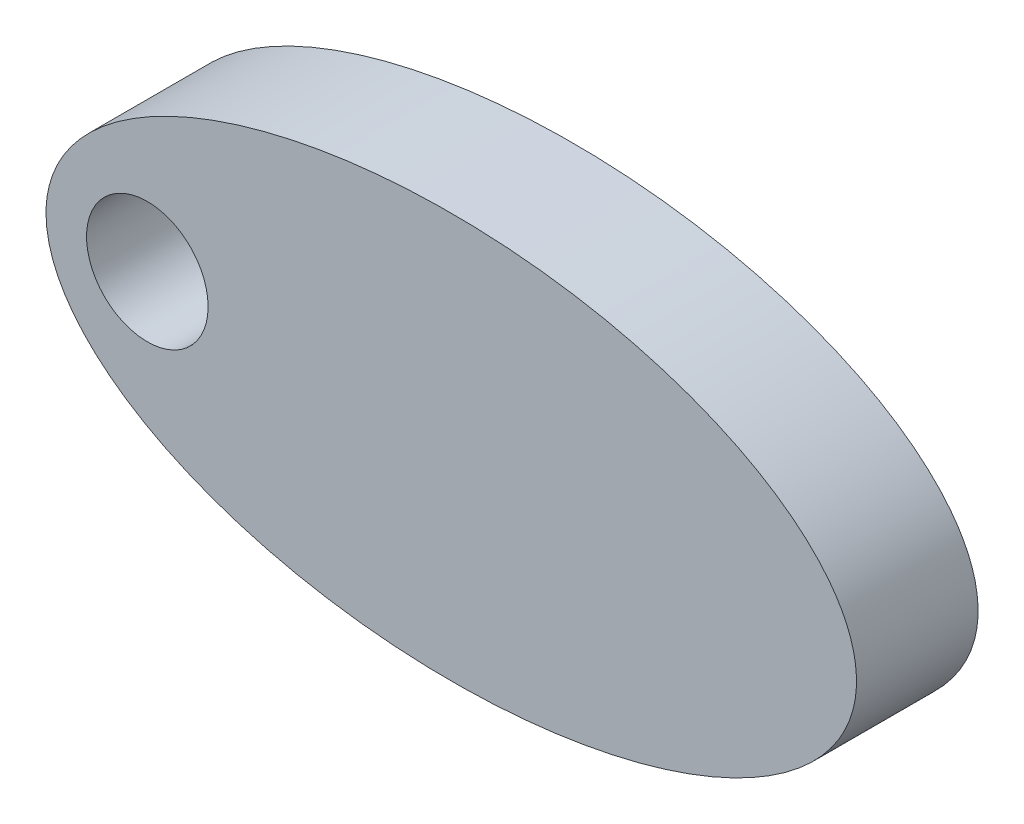
ISO-10303-21;
HEADER;
FILE_DESCRIPTION(('STEP AP214'),'2;1');
FILE_NAME('part.step','',(''),(''),'','','');
FILE_SCHEMA(('AUTOMOTIVE_DESIGN { 1 0 10303 214 1 1 1 1 }'));
ENDSEC;
DATA;
#1=APPLICATION_CONTEXT('core data for automotive mechanical design processes');
#2=APPLICATION_PROTOCOL_DEFINITION('international standard','automotive_design',2000,#1);
#3=PRODUCT_CONTEXT('',#1,'mechanical');
#4=PRODUCT('Part','Part','',(#3));
#5=PRODUCT_RELATED_PRODUCT_CATEGORY('part','',(#4));
#6=PRODUCT_DEFINITION_FORMATION('','',#4);
#7=PRODUCT_DEFINITION_CONTEXT('part definition',#1,'design');
#8=PRODUCT_DEFINITION('design','',#6,#7);
#9=PRODUCT_DEFINITION_SHAPE('','',#8);
#10=(LENGTH_UNIT() NAMED_UNIT(*) SI_UNIT(.MILLI.,.METRE.));
#11=(NAMED_UNIT(*) PLANE_ANGLE_UNIT() SI_UNIT($,.RADIAN.));
#12=(NAMED_UNIT(*) SI_UNIT($,.STERADIAN.) SOLID_ANGLE_UNIT());
#13=UNCERTAINTY_MEASURE_WITH_UNIT(LENGTH_MEASURE(1.E-05),#10,'distance_accuracy_value','');
#14=(GEOMETRIC_REPRESENTATION_CONTEXT(3) GLOBAL_UNCERTAINTY_ASSIGNED_CONTEXT((#13)) GLOBAL_UNIT_ASSIGNED_CONTEXT((#10,
#11,#12)) REPRESENTATION_CONTEXT('',''));
#15=CARTESIAN_POINT('',(0.,0.,0.));
#16=DIRECTION('',(0.,0.,1.));
#17=DIRECTION('',(1.,0.,0.));
#18=AXIS2_PLACEMENT_3D('',#15,#16,#17);
#19=CARTESIAN_POINT('',(0.,0.,3.));
#20=DIRECTION('',(0.,0.,1.));
#21=DIRECTION('',(1.,0.,0.));
#22=AXIS2_PLACEMENT_3D('',#19,#20,#21);
#23=PLANE('',#22);
#24=CARTESIAN_POINT('',(0.,0.,3.));
#25=DIRECTION('',(0.,0.,1.));
#26=DIRECTION('',(-1.,0.,0.));
#27=AXIS2_PLACEMENT_3D('',#24,#25,#26);
#28=ELLIPSE('',#27,10.,5.);
#29=CARTESIAN_POINT('',(-10.,0.,3.));
#30=VERTEX_POINT('',#29);
#31=EDGE_CURVE('E10',#30,#30,#28,.T.);
#32=ORIENTED_EDGE('',*,*,#31,.T.);
#33=EDGE_LOOP('',(#32));
#34=FACE_BOUND('',#33,.T.);
#35=CARTESIAN_POINT('',(-7.5,0.,3.));
#36=DIRECTION('',(0.,0.,1.));
#37=DIRECTION('',(1.,0.,0.));
#38=AXIS2_PLACEMENT_3D('',#35,#36,#37);
#39=CIRCLE('',#38,1.5);
#40=CARTESIAN_POINT('',(-6.,0.,3.));
#41=VERTEX_POINT('',#40);
#42=EDGE_CURVE('E44',#41,#41,#39,.T.);
#43=ORIENTED_EDGE('',*,*,#42,.F.);
#44=EDGE_LOOP('',(#43));
#45=FACE_BOUND('',#44,.T.);
#46=ADVANCED_FACE('F33',(#34,#45),#23,.T.);
#47=CARTESIAN_POINT('',(0.,0.,0.));
#48=DIRECTION('',(0.,0.,1.));
#49=DIRECTION('',(1.,0.,0.));
#50=AXIS2_PLACEMENT_3D('',#47,#48,#49);
#51=PLANE('',#50);
#52=CARTESIAN_POINT('',(0.,0.,0.));
#53=DIRECTION('',(0.,0.,1.));
#54=DIRECTION('',(-1.,0.,0.));
#55=AXIS2_PLACEMENT_3D('',#52,#53,#54);
#56=ELLIPSE('',#55,10.,5.);
#57=CARTESIAN_POINT('',(-10.,0.,0.));
#58=VERTEX_POINT('',#57);
#59=EDGE_CURVE('E38',#58,#58,#56,.T.);
#60=ORIENTED_EDGE('',*,*,#59,.F.);
#61=EDGE_LOOP('',(#60));
#62=FACE_BOUND('',#61,.T.);
#63=CARTESIAN_POINT('',(-7.5,0.,0.));
#64=DIRECTION('',(0.,0.,1.));
#65=DIRECTION('',(1.,0.,0.));
#66=AXIS2_PLACEMENT_3D('',#63,#64,#65);
#67=CIRCLE('',#66,1.5);
#68=CARTESIAN_POINT('',(-6.,0.,0.));
#69=VERTEX_POINT('',#68);
#70=EDGE_CURVE('E47',#69,#69,#67,.T.);
#71=ORIENTED_EDGE('',*,*,#70,.T.);
#72=EDGE_LOOP('',(#71));
#73=FACE_BOUND('',#72,.T.);
#74=ADVANCED_FACE('F57',(#62,#73),#51,.F.);
#75=DIRECTION('',(0.,0.,-1.));
#76=VECTOR('',#75,1.);
#77=SURFACE_OF_LINEAR_EXTRUSION('',#28,#76);
#78=ORIENTED_EDGE('',*,*,#31,.F.);
#79=EDGE_LOOP('',(#78));
#80=FACE_BOUND('',#79,.T.);
#81=ORIENTED_EDGE('',*,*,#59,.T.);
#82=EDGE_LOOP('',(#81));
#83=FACE_BOUND('',#82,.T.);
#84=ADVANCED_FACE('F35',(#80,#83),#77,.F.);
#85=CARTESIAN_POINT('',(-7.5,0.,3.));
#86=DIRECTION('',(0.,0.,-1.));
#87=DIRECTION('',(-1.,0.,0.));
#88=AXIS2_PLACEMENT_3D('',#85,#86,#87);
#89=CYLINDRICAL_SURFACE('',#88,1.5);
#90=ORIENTED_EDGE('',*,*,#42,.T.);
#91=EDGE_LOOP('',(#90));
#92=FACE_BOUND('',#91,.T.);
#93=ORIENTED_EDGE('',*,*,#70,.F.);
#94=EDGE_LOOP('',(#93));
#95=FACE_BOUND('',#94,.T.);
#96=ADVANCED_FACE('F53',(#92,#95),#89,.F.);
#97=CLOSED_SHELL('',(#46,#74,#84,#96));
#98=MANIFOLD_SOLID_BREP('B2',#97);
#99=ADVANCED_BREP_SHAPE_REPRESENTATION('',(#18,#98),#14);
#100=SHAPE_DEFINITION_REPRESENTATION(#9,#99);
ENDSEC;
END-ISO-10303-21;
